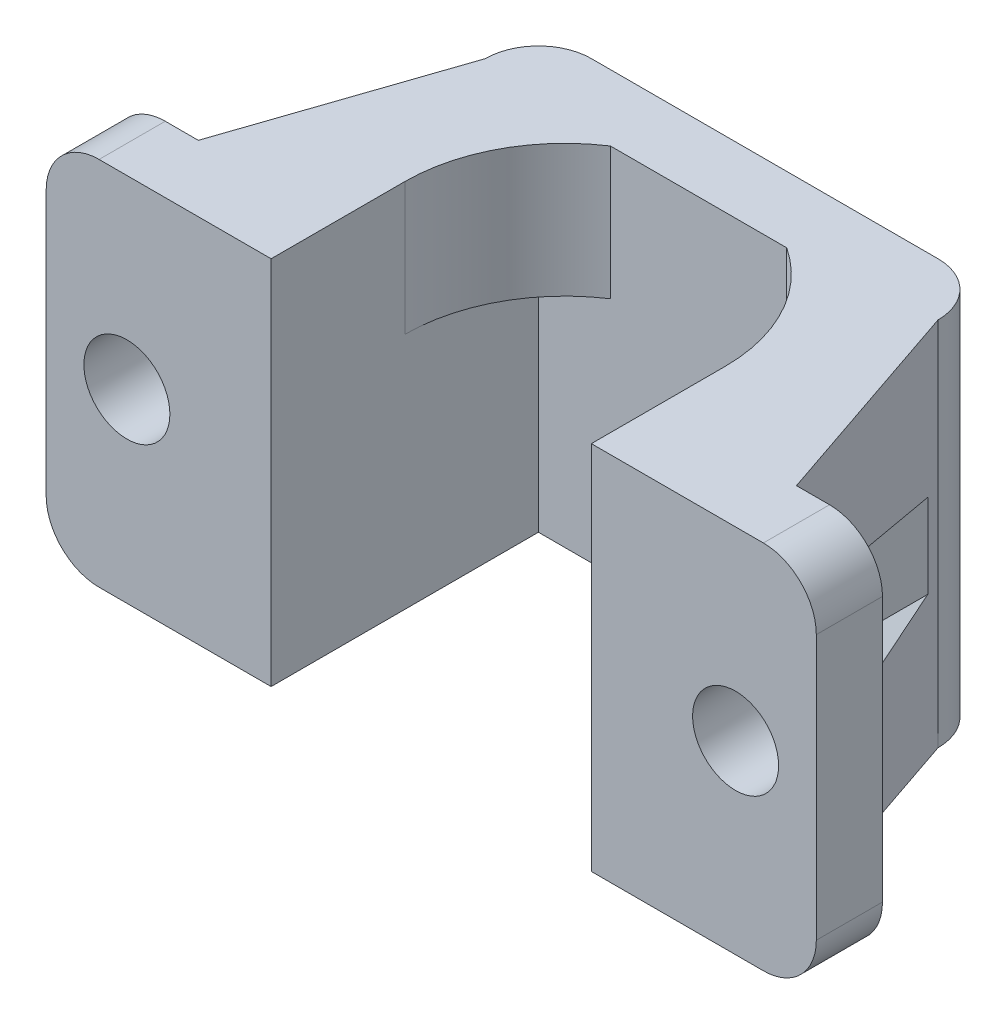
ISO-10303-21;
HEADER;
FILE_DESCRIPTION(('STEP AP214'),'2;1');
FILE_NAME('part.step','',(''),(''),'','','');
FILE_SCHEMA(('AUTOMOTIVE_DESIGN { 1 0 10303 214 1 1 1 1 }'));
ENDSEC;
DATA;
#1=APPLICATION_CONTEXT('core data for automotive mechanical design processes');
#2=APPLICATION_PROTOCOL_DEFINITION('international standard','automotive_design',2000,#1);
#3=PRODUCT_CONTEXT('',#1,'mechanical');
#4=PRODUCT('Part','Part','',(#3));
#5=PRODUCT_RELATED_PRODUCT_CATEGORY('part','',(#4));
#6=PRODUCT_DEFINITION_FORMATION('','',#4);
#7=PRODUCT_DEFINITION_CONTEXT('part definition',#1,'design');
#8=PRODUCT_DEFINITION('design','',#6,#7);
#9=PRODUCT_DEFINITION_SHAPE('','',#8);
#10=(LENGTH_UNIT() NAMED_UNIT(*) SI_UNIT(.MILLI.,.METRE.));
#11=(NAMED_UNIT(*) PLANE_ANGLE_UNIT() SI_UNIT($,.RADIAN.));
#12=(NAMED_UNIT(*) SI_UNIT($,.STERADIAN.) SOLID_ANGLE_UNIT());
#13=UNCERTAINTY_MEASURE_WITH_UNIT(LENGTH_MEASURE(1.E-05),#10,'distance_accuracy_value','');
#14=(GEOMETRIC_REPRESENTATION_CONTEXT(3) GLOBAL_UNCERTAINTY_ASSIGNED_CONTEXT((#13)) GLOBAL_UNIT_ASSIGNED_CONTEXT((#10,
#11,#12)) REPRESENTATION_CONTEXT('',''));
#15=CARTESIAN_POINT('',(0.,0.,0.));
#16=DIRECTION('',(0.,0.,1.));
#17=DIRECTION('',(1.,0.,0.));
#18=AXIS2_PLACEMENT_3D('',#15,#16,#17);
#19=CARTESIAN_POINT('',(0.,14.,-10.1));
#20=DIRECTION('',(0.,0.,-1.));
#21=DIRECTION('',(-1.,0.,0.));
#22=AXIS2_PLACEMENT_3D('',#19,#20,#21);
#23=PLANE('',#22);
#24=DIRECTION('',(0.,1.,0.));
#25=VECTOR('',#24,1.);
#26=CARTESIAN_POINT('',(3.33166624979154,9.,-10.1));
#27=LINE('',#26,#25);
#28=CARTESIAN_POINT('',(3.33166624979154,9.,-10.1));
#29=VERTEX_POINT('',#28);
#30=CARTESIAN_POINT('',(3.33166624979154,14.,-10.1));
#31=VERTEX_POINT('',#30);
#32=EDGE_CURVE('E509',#29,#31,#27,.T.);
#33=ORIENTED_EDGE('',*,*,#32,.T.);
#34=DIRECTION('',(1.,0.,0.));
#35=VECTOR('',#34,1.);
#36=CARTESIAN_POINT('',(0.,14.,-10.1));
#37=LINE('',#36,#35);
#38=CARTESIAN_POINT('',(-3.33166624979154,14.,-10.1));
#39=VERTEX_POINT('',#38);
#40=EDGE_CURVE('E238',#39,#31,#37,.T.);
#41=ORIENTED_EDGE('',*,*,#40,.F.);
#42=DIRECTION('',(0.,1.,0.));
#43=VECTOR('',#42,1.);
#44=CARTESIAN_POINT('',(-3.33166624979154,9.,-10.1));
#45=LINE('',#44,#43);
#46=CARTESIAN_POINT('',(-3.33166624979154,9.,-10.1));
#47=VERTEX_POINT('',#46);
#48=EDGE_CURVE('E231',#47,#39,#45,.T.);
#49=ORIENTED_EDGE('',*,*,#48,.F.);
#50=DIRECTION('',(1.,0.,0.));
#51=VECTOR('',#50,1.);
#52=CARTESIAN_POINT('',(0.,9.,-10.1));
#53=LINE('',#52,#51);
#54=CARTESIAN_POINT('',(-6.05,9.,-10.1));
#55=VERTEX_POINT('',#54);
#56=EDGE_CURVE('E218',#55,#47,#53,.T.);
#57=ORIENTED_EDGE('',*,*,#56,.F.);
#58=DIRECTION('',(0.,-1.,0.));
#59=VECTOR('',#58,1.);
#60=CARTESIAN_POINT('',(-6.05,14.,-10.1));
#61=LINE('',#60,#59);
#62=CARTESIAN_POINT('',(-6.05,0.,-10.1));
#63=VERTEX_POINT('',#62);
#64=EDGE_CURVE('E353',#55,#63,#61,.T.);
#65=ORIENTED_EDGE('',*,*,#64,.T.);
#66=DIRECTION('',(1.,0.,0.));
#67=VECTOR('',#66,1.);
#68=CARTESIAN_POINT('',(0.,0.,-10.1));
#69=LINE('',#68,#67);
#70=CARTESIAN_POINT('',(6.05,0.,-10.1));
#71=VERTEX_POINT('',#70);
#72=EDGE_CURVE('E321',#63,#71,#69,.T.);
#73=ORIENTED_EDGE('',*,*,#72,.T.);
#74=DIRECTION('',(0.,-1.,0.));
#75=VECTOR('',#74,1.);
#76=CARTESIAN_POINT('',(6.05,14.,-10.1));
#77=LINE('',#76,#75);
#78=CARTESIAN_POINT('',(6.05,9.,-10.1));
#79=VERTEX_POINT('',#78);
#80=EDGE_CURVE('E351',#79,#71,#77,.T.);
#81=ORIENTED_EDGE('',*,*,#80,.F.);
#82=DIRECTION('',(1.,0.,0.));
#83=VECTOR('',#82,1.);
#84=CARTESIAN_POINT('',(0.,9.,-10.1));
#85=LINE('',#84,#83);
#86=EDGE_CURVE('E49',#29,#79,#85,.T.);
#87=ORIENTED_EDGE('',*,*,#86,.F.);
#88=EDGE_LOOP('',(#33,#41,#49,#57,#65,#73,#81,#87));
#89=FACE_BOUND('',#88,.T.);
#90=ADVANCED_FACE('F34',(#89),#23,.F.);
#91=CARTESIAN_POINT('',(-10.8931702483857,14.,-3.69829854111859));
#92=DIRECTION('',(-0.946915165682052,0.,-0.3214835439044));
#93=DIRECTION('',(-0.3214835439044,0.,0.946915165682052));
#94=AXIS2_PLACEMENT_3D('',#91,#92,#93);
#95=PLANE('',#94);
#96=DIRECTION('',(0.316084994021358,-0.182491756385032,-0.931013982390181));
#97=VECTOR('',#96,1.);
#98=CARTESIAN_POINT('',(-11.1339921597044,9.96411175542277,-2.98896854777974));
#99=LINE('',#98,#97);
#100=CARTESIAN_POINT('',(-11.3,10.059956426705,-2.5));
#101=VERTEX_POINT('',#100);
#102=CARTESIAN_POINT('',(-8.75,8.58771324027147,-10.0109090909091));
#103=VERTEX_POINT('',#102);
#104=EDGE_CURVE('E270',#101,#103,#99,.T.);
#105=ORIENTED_EDGE('',*,*,#104,.F.);
#106=DIRECTION('',(0.,-1.,0.));
#107=VECTOR('',#106,1.);
#108=CARTESIAN_POINT('',(-11.3,14.,-2.5));
#109=LINE('',#108,#107);
#110=CARTESIAN_POINT('',(-11.3,14.,-2.5));
#111=VERTEX_POINT('',#110);
#112=EDGE_CURVE('E364',#111,#101,#109,.T.);
#113=ORIENTED_EDGE('',*,*,#112,.F.);
#114=DIRECTION('',(0.3214835439044,0.,-0.946915165682052));
#115=VECTOR('',#114,1.);
#116=CARTESIAN_POINT('',(-10.8931702483857,14.,-3.69829854111859));
#117=LINE('',#116,#115);
#118=CARTESIAN_POINT('',(-8.55,14.,-10.6));
#119=VERTEX_POINT('',#118);
#120=EDGE_CURVE('E285',#111,#119,#117,.T.);
#121=ORIENTED_EDGE('',*,*,#120,.T.);
#122=DIRECTION('',(0.,-1.,0.));
#123=VECTOR('',#122,1.);
#124=CARTESIAN_POINT('',(-8.55,14.,-10.6));
#125=LINE('',#124,#123);
#126=CARTESIAN_POINT('',(-8.55,0.,-10.6));
#127=VERTEX_POINT('',#126);
#128=EDGE_CURVE('E367',#119,#127,#125,.T.);
#129=ORIENTED_EDGE('',*,*,#128,.T.);
#130=DIRECTION('',(0.3214835439044,0.,-0.946915165682052));
#131=VECTOR('',#130,1.);
#132=CARTESIAN_POINT('',(-10.8931702483857,0.,-3.69829854111859));
#133=LINE('',#132,#131);
#134=CARTESIAN_POINT('',(-11.3,0.,-2.5));
#135=VERTEX_POINT('',#134);
#136=EDGE_CURVE('E284',#135,#127,#133,.T.);
#137=ORIENTED_EDGE('',*,*,#136,.F.);
#138=CARTESIAN_POINT('',(-11.3,3.94004357329499,-2.5));
#139=VERTEX_POINT('',#138);
#140=EDGE_CURVE('E363',#139,#135,#109,.T.);
#141=ORIENTED_EDGE('',*,*,#140,.F.);
#142=DIRECTION('',(-0.316084994021358,-0.182491756385032,0.931013982390181));
#143=VECTOR('',#142,1.);
#144=CARTESIAN_POINT('',(-10.3264314795417,4.50213362065615,-5.36760182389544));
#145=LINE('',#144,#143);
#146=CARTESIAN_POINT('',(-8.75,5.41228675972853,-10.0109090909091));
#147=VERTEX_POINT('',#146);
#148=EDGE_CURVE('E267',#147,#139,#145,.T.);
#149=ORIENTED_EDGE('',*,*,#148,.F.);
#150=DIRECTION('',(0.,-1.,0.));
#151=VECTOR('',#150,1.);
#152=CARTESIAN_POINT('',(-8.75,14.,-10.0109090909091));
#153=LINE('',#152,#151);
#154=EDGE_CURVE('E370',#103,#147,#153,.T.);
#155=ORIENTED_EDGE('',*,*,#154,.F.);
#156=EDGE_LOOP('',(#105,#113,#121,#129,#137,#141,#149,#155));
#157=FACE_BOUND('',#156,.T.);
#158=ADVANCED_FACE('F452',(#157),#95,.T.);
#159=CARTESIAN_POINT('',(0.,14.,-2.5));
#160=DIRECTION('',(0.,0.,-1.));
#161=DIRECTION('',(-1.,0.,0.));
#162=AXIS2_PLACEMENT_3D('',#159,#160,#161);
#163=PLANE('',#162);
#164=DIRECTION('',(1.,0.,0.));
#165=VECTOR('',#164,1.);
#166=CARTESIAN_POINT('',(0.,0.,-2.5));
#167=LINE('',#166,#165);
#168=CARTESIAN_POINT('',(-12.55,0.,-2.5));
#169=VERTEX_POINT('',#168);
#170=EDGE_CURVE('E313',#169,#135,#167,.T.);
#171=ORIENTED_EDGE('',*,*,#170,.F.);
#172=CARTESIAN_POINT('',(-12.55,2.,-2.5));
#173=DIRECTION('',(0.,0.,-1.));
#174=DIRECTION('',(-1.,0.,0.));
#175=AXIS2_PLACEMENT_3D('',#172,#173,#174);
#176=CIRCLE('',#175,2.);
#177=CARTESIAN_POINT('',(-14.55,2.,-2.5));
#178=VERTEX_POINT('',#177);
#179=EDGE_CURVE('E419',#169,#178,#176,.T.);
#180=ORIENTED_EDGE('',*,*,#179,.T.);
#181=DIRECTION('',(0.,-1.,0.));
#182=VECTOR('',#181,1.);
#183=CARTESIAN_POINT('',(-14.55,14.,-2.5));
#184=LINE('',#183,#182);
#185=CARTESIAN_POINT('',(-14.55,12.,-2.5));
#186=VERTEX_POINT('',#185);
#187=EDGE_CURVE('E360',#186,#178,#184,.T.);
#188=ORIENTED_EDGE('',*,*,#187,.F.);
#189=CARTESIAN_POINT('',(-12.55,12.,-2.5));
#190=DIRECTION('',(0.,0.,-1.));
#191=DIRECTION('',(-1.,0.,0.));
#192=AXIS2_PLACEMENT_3D('',#189,#190,#191);
#193=CIRCLE('',#192,2.);
#194=CARTESIAN_POINT('',(-12.55,14.,-2.5));
#195=VERTEX_POINT('',#194);
#196=EDGE_CURVE('E417',#186,#195,#193,.T.);
#197=ORIENTED_EDGE('',*,*,#196,.T.);
#198=DIRECTION('',(1.,0.,0.));
#199=VECTOR('',#198,1.);
#200=CARTESIAN_POINT('',(0.,14.,-2.5));
#201=LINE('',#200,#199);
#202=EDGE_CURVE('E288',#195,#111,#201,.T.);
#203=ORIENTED_EDGE('',*,*,#202,.T.);
#204=ORIENTED_EDGE('',*,*,#112,.T.);
#205=DIRECTION('',(-0.866025403784439,0.5,0.));
#206=VECTOR('',#205,1.);
#207=CARTESIAN_POINT('',(-8.75,8.58771324027147,-2.5));
#208=LINE('',#207,#206);
#209=CARTESIAN_POINT('',(-8.75,8.58771324027147,-2.5));
#210=VERTEX_POINT('',#209);
#211=EDGE_CURVE('E262',#210,#101,#208,.T.);
#212=ORIENTED_EDGE('',*,*,#211,.F.);
#213=DIRECTION('',(0.,1.,0.));
#214=VECTOR('',#213,1.);
#215=CARTESIAN_POINT('',(-8.75,5.41228675972853,-2.5));
#216=LINE('',#215,#214);
#217=CARTESIAN_POINT('',(-8.75,5.41228675972853,-2.5));
#218=VERTEX_POINT('',#217);
#219=EDGE_CURVE('E259',#218,#210,#216,.T.);
#220=ORIENTED_EDGE('',*,*,#219,.F.);
#221=DIRECTION('',(0.866025403784438,0.5,0.));
#222=VECTOR('',#221,1.);
#223=CARTESIAN_POINT('',(-11.5,3.82457351945706,-2.5));
#224=LINE('',#223,#222);
#225=EDGE_CURVE('E255',#139,#218,#224,.T.);
#226=ORIENTED_EDGE('',*,*,#225,.F.);
#227=ORIENTED_EDGE('',*,*,#140,.T.);
#228=EDGE_LOOP('',(#171,#180,#188,#197,#203,#204,#212,#220,#226,#227));
#229=FACE_BOUND('',#228,.T.);
#230=CARTESIAN_POINT('',(-11.5,7.,-2.5));
#231=DIRECTION('',(0.,0.,-1.));
#232=DIRECTION('',(-1.,0.,0.));
#233=AXIS2_PLACEMENT_3D('',#230,#231,#232);
#234=CIRCLE('',#233,1.625);
#235=CARTESIAN_POINT('',(-13.125,7.,-2.5));
#236=VERTEX_POINT('',#235);
#237=EDGE_CURVE('E281',#236,#236,#234,.T.);
#238=ORIENTED_EDGE('',*,*,#237,.F.);
#239=EDGE_LOOP('',(#238));
#240=FACE_BOUND('',#239,.T.);
#241=ADVANCED_FACE('F441',(#229,#240),#163,.T.);
#242=CARTESIAN_POINT('',(-14.55,14.,0.));
#243=DIRECTION('',(-1.,0.,0.));
#244=DIRECTION('',(0.,0.,1.));
#245=AXIS2_PLACEMENT_3D('',#242,#243,#244);
#246=PLANE('',#245);
#247=ORIENTED_EDGE('',*,*,#187,.T.);
#248=DIRECTION('',(0.,0.,-1.));
#249=VECTOR('',#248,1.);
#250=CARTESIAN_POINT('',(-14.55,2.,0.));
#251=LINE('',#250,#249);
#252=CARTESIAN_POINT('',(-14.55,2.,0.));
#253=VERTEX_POINT('',#252);
#254=EDGE_CURVE('E424',#178,#253,#251,.F.);
#255=ORIENTED_EDGE('',*,*,#254,.T.);
#256=DIRECTION('',(0.,-1.,0.));
#257=VECTOR('',#256,1.);
#258=CARTESIAN_POINT('',(-14.55,14.,0.));
#259=LINE('',#258,#257);
#260=CARTESIAN_POINT('',(-14.55,12.,0.));
#261=VERTEX_POINT('',#260);
#262=EDGE_CURVE('E357',#261,#253,#259,.T.);
#263=ORIENTED_EDGE('',*,*,#262,.F.);
#264=DIRECTION('',(0.,0.,-1.));
#265=VECTOR('',#264,1.);
#266=CARTESIAN_POINT('',(-14.55,12.,0.));
#267=LINE('',#266,#265);
#268=EDGE_CURVE('E421',#261,#186,#267,.T.);
#269=ORIENTED_EDGE('',*,*,#268,.T.);
#270=EDGE_LOOP('',(#247,#255,#263,#269));
#271=FACE_BOUND('',#270,.T.);
#272=ADVANCED_FACE('F435',(#271),#246,.T.);
#273=CARTESIAN_POINT('',(0.,14.,0.));
#274=DIRECTION('',(0.,0.,1.));
#275=DIRECTION('',(1.,0.,0.));
#276=AXIS2_PLACEMENT_3D('',#273,#274,#275);
#277=PLANE('',#276);
#278=CARTESIAN_POINT('',(-11.5,7.,0.));
#279=DIRECTION('',(0.,0.,1.));
#280=DIRECTION('',(1.,0.,0.));
#281=AXIS2_PLACEMENT_3D('',#278,#279,#280);
#282=CIRCLE('',#281,1.625);
#283=CARTESIAN_POINT('',(-9.875,7.,0.));
#284=VERTEX_POINT('',#283);
#285=EDGE_CURVE('E278',#284,#284,#282,.T.);
#286=ORIENTED_EDGE('',*,*,#285,.F.);
#287=EDGE_LOOP('',(#286));
#288=FACE_BOUND('',#287,.T.);
#289=ORIENTED_EDGE('',*,*,#262,.T.);
#290=CARTESIAN_POINT('',(-12.55,2.,0.));
#291=DIRECTION('',(0.,0.,1.));
#292=DIRECTION('',(1.,0.,0.));
#293=AXIS2_PLACEMENT_3D('',#290,#291,#292);
#294=CIRCLE('',#293,2.);
#295=CARTESIAN_POINT('',(-12.55,0.,0.));
#296=VERTEX_POINT('',#295);
#297=EDGE_CURVE('E11',#253,#296,#294,.T.);
#298=ORIENTED_EDGE('',*,*,#297,.T.);
#299=DIRECTION('',(-1.,0.,0.));
#300=VECTOR('',#299,1.);
#301=CARTESIAN_POINT('',(0.,0.,0.));
#302=LINE('',#301,#300);
#303=CARTESIAN_POINT('',(-6.05,0.,0.));
#304=VERTEX_POINT('',#303);
#305=EDGE_CURVE('E315',#304,#296,#302,.T.);
#306=ORIENTED_EDGE('',*,*,#305,.F.);
#307=DIRECTION('',(0.,-1.,0.));
#308=VECTOR('',#307,1.);
#309=CARTESIAN_POINT('',(-6.05,14.,0.));
#310=LINE('',#309,#308);
#311=CARTESIAN_POINT('',(-6.05,14.,0.));
#312=VERTEX_POINT('',#311);
#313=EDGE_CURVE('E355',#312,#304,#310,.T.);
#314=ORIENTED_EDGE('',*,*,#313,.F.);
#315=DIRECTION('',(-1.,0.,0.));
#316=VECTOR('',#315,1.);
#317=CARTESIAN_POINT('',(0.,14.,0.));
#318=LINE('',#317,#316);
#319=CARTESIAN_POINT('',(-12.55,14.,0.));
#320=VERTEX_POINT('',#319);
#321=EDGE_CURVE('E291',#312,#320,#318,.T.);
#322=ORIENTED_EDGE('',*,*,#321,.T.);
#323=CARTESIAN_POINT('',(-12.55,12.,0.));
#324=DIRECTION('',(0.,0.,1.));
#325=DIRECTION('',(1.,0.,0.));
#326=AXIS2_PLACEMENT_3D('',#323,#324,#325);
#327=CIRCLE('',#326,2.);
#328=EDGE_CURVE('E42',#320,#261,#327,.T.);
#329=ORIENTED_EDGE('',*,*,#328,.T.);
#330=EDGE_LOOP('',(#289,#298,#306,#314,#322,#329));
#331=FACE_BOUND('',#330,.T.);
#332=ADVANCED_FACE('F428',(#288,#331),#277,.T.);
#333=CARTESIAN_POINT('',(-6.05,14.,0.));
#334=DIRECTION('',(-1.,0.,0.));
#335=DIRECTION('',(0.,0.,1.));
#336=AXIS2_PLACEMENT_3D('',#333,#334,#335);
#337=PLANE('',#336);
#338=DIRECTION('',(0.,0.,-1.));
#339=VECTOR('',#338,1.);
#340=CARTESIAN_POINT('',(-6.05,9.,0.));
#341=LINE('',#340,#339);
#342=CARTESIAN_POINT('',(-6.05,9.,-5.05));
#343=VERTEX_POINT('',#342);
#344=EDGE_CURVE('E224',#343,#55,#341,.T.);
#345=ORIENTED_EDGE('',*,*,#344,.F.);
#346=DIRECTION('',(0.,1.,0.));
#347=VECTOR('',#346,1.);
#348=CARTESIAN_POINT('',(-6.05,9.,-5.05));
#349=LINE('',#348,#347);
#350=CARTESIAN_POINT('',(-6.05,14.,-5.05));
#351=VERTEX_POINT('',#350);
#352=EDGE_CURVE('E234',#343,#351,#349,.T.);
#353=ORIENTED_EDGE('',*,*,#352,.T.);
#354=DIRECTION('',(0.,0.,-1.));
#355=VECTOR('',#354,1.);
#356=CARTESIAN_POINT('',(-6.05,14.,0.));
#357=LINE('',#356,#355);
#358=EDGE_CURVE('E294',#312,#351,#357,.T.);
#359=ORIENTED_EDGE('',*,*,#358,.F.);
#360=ORIENTED_EDGE('',*,*,#313,.T.);
#361=DIRECTION('',(0.,0.,-1.));
#362=VECTOR('',#361,1.);
#363=CARTESIAN_POINT('',(-6.05,0.,0.));
#364=LINE('',#363,#362);
#365=EDGE_CURVE('E318',#304,#63,#364,.T.);
#366=ORIENTED_EDGE('',*,*,#365,.T.);
#367=ORIENTED_EDGE('',*,*,#64,.F.);
#368=EDGE_LOOP('',(#345,#353,#359,#360,#366,#367));
#369=FACE_BOUND('',#368,.T.);
#370=ADVANCED_FACE('F517',(#369),#337,.F.);
#371=CARTESIAN_POINT('',(6.05,14.,0.));
#372=DIRECTION('',(-1.,0.,0.));
#373=DIRECTION('',(0.,0.,1.));
#374=AXIS2_PLACEMENT_3D('',#371,#372,#373);
#375=PLANE('',#374);
#376=DIRECTION('',(0.,1.,0.));
#377=VECTOR('',#376,1.);
#378=CARTESIAN_POINT('',(6.05,9.,-5.05));
#379=LINE('',#378,#377);
#380=CARTESIAN_POINT('',(6.05,9.,-5.05));
#381=VERTEX_POINT('',#380);
#382=CARTESIAN_POINT('',(6.05,14.,-5.05));
#383=VERTEX_POINT('',#382);
#384=EDGE_CURVE('E57',#381,#383,#379,.T.);
#385=ORIENTED_EDGE('',*,*,#384,.F.);
#386=DIRECTION('',(0.,0.,1.));
#387=VECTOR('',#386,1.);
#388=CARTESIAN_POINT('',(6.05,9.,0.));
#389=LINE('',#388,#387);
#390=EDGE_CURVE('E512',#79,#381,#389,.T.);
#391=ORIENTED_EDGE('',*,*,#390,.F.);
#392=ORIENTED_EDGE('',*,*,#80,.T.);
#393=DIRECTION('',(0.,0.,-1.));
#394=VECTOR('',#393,1.);
#395=CARTESIAN_POINT('',(6.05,0.,0.));
#396=LINE('',#395,#394);
#397=CARTESIAN_POINT('',(6.05,0.,0.));
#398=VERTEX_POINT('',#397);
#399=EDGE_CURVE('E324',#398,#71,#396,.T.);
#400=ORIENTED_EDGE('',*,*,#399,.F.);
#401=DIRECTION('',(0.,-1.,0.));
#402=VECTOR('',#401,1.);
#403=CARTESIAN_POINT('',(6.05,14.,0.));
#404=LINE('',#403,#402);
#405=CARTESIAN_POINT('',(6.05,14.,0.));
#406=VERTEX_POINT('',#405);
#407=EDGE_CURVE('E349',#406,#398,#404,.T.);
#408=ORIENTED_EDGE('',*,*,#407,.F.);
#409=DIRECTION('',(0.,0.,-1.));
#410=VECTOR('',#409,1.);
#411=CARTESIAN_POINT('',(6.05,14.,0.));
#412=LINE('',#411,#410);
#413=EDGE_CURVE('E298',#406,#383,#412,.T.);
#414=ORIENTED_EDGE('',*,*,#413,.T.);
#415=EDGE_LOOP('',(#385,#391,#392,#400,#408,#414));
#416=FACE_BOUND('',#415,.T.);
#417=ADVANCED_FACE('F502',(#416),#375,.T.);
#418=CARTESIAN_POINT('',(0.,14.,0.));
#419=DIRECTION('',(0.,0.,-1.));
#420=DIRECTION('',(-1.,0.,0.));
#421=AXIS2_PLACEMENT_3D('',#418,#419,#420);
#422=PLANE('',#421);
#423=CARTESIAN_POINT('',(11.5,7.,0.));
#424=DIRECTION('',(0.,0.,1.));
#425=DIRECTION('',(-1.,0.,0.));
#426=AXIS2_PLACEMENT_3D('',#423,#424,#425);
#427=CIRCLE('',#426,1.625);
#428=CARTESIAN_POINT('',(9.875,7.,0.));
#429=VERTEX_POINT('',#428);
#430=EDGE_CURVE('E272',#429,#429,#427,.T.);
#431=ORIENTED_EDGE('',*,*,#430,.F.);
#432=EDGE_LOOP('',(#431));
#433=FACE_BOUND('',#432,.T.);
#434=DIRECTION('',(1.,0.,0.));
#435=VECTOR('',#434,1.);
#436=CARTESIAN_POINT('',(0.,0.,0.));
#437=LINE('',#436,#435);
#438=CARTESIAN_POINT('',(12.55,0.,0.));
#439=VERTEX_POINT('',#438);
#440=EDGE_CURVE('E327',#398,#439,#437,.T.);
#441=ORIENTED_EDGE('',*,*,#440,.T.);
#442=CARTESIAN_POINT('',(12.55,2.,0.));
#443=DIRECTION('',(0.,0.,-1.));
#444=DIRECTION('',(-1.,0.,0.));
#445=AXIS2_PLACEMENT_3D('',#442,#443,#444);
#446=CIRCLE('',#445,2.);
#447=CARTESIAN_POINT('',(14.55,2.,0.));
#448=VERTEX_POINT('',#447);
#449=EDGE_CURVE('E415',#439,#448,#446,.F.);
#450=ORIENTED_EDGE('',*,*,#449,.T.);
#451=DIRECTION('',(0.,-1.,0.));
#452=VECTOR('',#451,1.);
#453=CARTESIAN_POINT('',(14.55,14.,0.));
#454=LINE('',#453,#452);
#455=CARTESIAN_POINT('',(14.55,12.,0.));
#456=VERTEX_POINT('',#455);
#457=EDGE_CURVE('E346',#456,#448,#454,.T.);
#458=ORIENTED_EDGE('',*,*,#457,.F.);
#459=CARTESIAN_POINT('',(12.55,12.,0.));
#460=DIRECTION('',(0.,0.,-1.));
#461=DIRECTION('',(-1.,0.,0.));
#462=AXIS2_PLACEMENT_3D('',#459,#460,#461);
#463=CIRCLE('',#462,2.);
#464=CARTESIAN_POINT('',(12.55,14.,0.));
#465=VERTEX_POINT('',#464);
#466=EDGE_CURVE('E413',#456,#465,#463,.F.);
#467=ORIENTED_EDGE('',*,*,#466,.T.);
#468=DIRECTION('',(1.,0.,0.));
#469=VECTOR('',#468,1.);
#470=CARTESIAN_POINT('',(0.,14.,0.));
#471=LINE('',#470,#469);
#472=EDGE_CURVE('E300',#406,#465,#471,.T.);
#473=ORIENTED_EDGE('',*,*,#472,.F.);
#474=ORIENTED_EDGE('',*,*,#407,.T.);
#475=EDGE_LOOP('',(#441,#450,#458,#467,#473,#474));
#476=FACE_BOUND('',#475,.T.);
#477=ADVANCED_FACE('F487',(#433,#476),#422,.F.);
#478=CARTESIAN_POINT('',(14.55,14.,0.));
#479=DIRECTION('',(-1.,0.,0.));
#480=DIRECTION('',(0.,0.,1.));
#481=AXIS2_PLACEMENT_3D('',#478,#479,#480);
#482=PLANE('',#481);
#483=ORIENTED_EDGE('',*,*,#457,.T.);
#484=DIRECTION('',(0.,0.,-1.));
#485=VECTOR('',#484,1.);
#486=CARTESIAN_POINT('',(14.55,2.,0.));
#487=LINE('',#486,#485);
#488=CARTESIAN_POINT('',(14.55,2.,-2.5));
#489=VERTEX_POINT('',#488);
#490=EDGE_CURVE('E406',#448,#489,#487,.T.);
#491=ORIENTED_EDGE('',*,*,#490,.T.);
#492=DIRECTION('',(0.,-1.,0.));
#493=VECTOR('',#492,1.);
#494=CARTESIAN_POINT('',(14.55,14.,-2.5));
#495=LINE('',#494,#493);
#496=CARTESIAN_POINT('',(14.55,12.,-2.5));
#497=VERTEX_POINT('',#496);
#498=EDGE_CURVE('E343',#497,#489,#495,.T.);
#499=ORIENTED_EDGE('',*,*,#498,.F.);
#500=DIRECTION('',(0.,0.,-1.));
#501=VECTOR('',#500,1.);
#502=CARTESIAN_POINT('',(14.55,12.,0.));
#503=LINE('',#502,#501);
#504=EDGE_CURVE('E404',#497,#456,#503,.F.);
#505=ORIENTED_EDGE('',*,*,#504,.T.);
#506=EDGE_LOOP('',(#483,#491,#499,#505));
#507=FACE_BOUND('',#506,.T.);
#508=ADVANCED_FACE('F490',(#507),#482,.F.);
#509=CARTESIAN_POINT('',(0.,14.,-2.5));
#510=DIRECTION('',(0.,0.,1.));
#511=DIRECTION('',(1.,0.,0.));
#512=AXIS2_PLACEMENT_3D('',#509,#510,#511);
#513=PLANE('',#512);
#514=ORIENTED_EDGE('',*,*,#498,.T.);
#515=CARTESIAN_POINT('',(12.55,2.,-2.5));
#516=DIRECTION('',(0.,0.,1.));
#517=DIRECTION('',(1.,0.,0.));
#518=AXIS2_PLACEMENT_3D('',#515,#516,#517);
#519=CIRCLE('',#518,2.);
#520=CARTESIAN_POINT('',(12.55,0.,-2.5));
#521=VERTEX_POINT('',#520);
#522=EDGE_CURVE('E411',#489,#521,#519,.F.);
#523=ORIENTED_EDGE('',*,*,#522,.T.);
#524=DIRECTION('',(-1.,0.,0.));
#525=VECTOR('',#524,1.);
#526=CARTESIAN_POINT('',(0.,0.,-2.5));
#527=LINE('',#526,#525);
#528=CARTESIAN_POINT('',(11.3,0.,-2.5));
#529=VERTEX_POINT('',#528);
#530=EDGE_CURVE('E330',#521,#529,#527,.T.);
#531=ORIENTED_EDGE('',*,*,#530,.T.);
#532=DIRECTION('',(0.,-1.,0.));
#533=VECTOR('',#532,1.);
#534=CARTESIAN_POINT('',(11.3,14.,-2.5));
#535=LINE('',#534,#533);
#536=CARTESIAN_POINT('',(11.3,3.94004357329498,-2.5));
#537=VERTEX_POINT('',#536);
#538=EDGE_CURVE('E339',#537,#529,#535,.T.);
#539=ORIENTED_EDGE('',*,*,#538,.F.);
#540=DIRECTION('',(0.866025403784439,-0.5,0.));
#541=VECTOR('',#540,1.);
#542=CARTESIAN_POINT('',(8.75,5.41228675972853,-2.5));
#543=LINE('',#542,#541);
#544=CARTESIAN_POINT('',(8.75,5.41228675972853,-2.5));
#545=VERTEX_POINT('',#544);
#546=EDGE_CURVE('E240',#545,#537,#543,.T.);
#547=ORIENTED_EDGE('',*,*,#546,.F.);
#548=DIRECTION('',(0.,-1.,0.));
#549=VECTOR('',#548,1.);
#550=CARTESIAN_POINT('',(8.75,8.58771324027147,-2.5));
#551=LINE('',#550,#549);
#552=CARTESIAN_POINT('',(8.75,8.58771324027147,-2.5));
#553=VERTEX_POINT('',#552);
#554=EDGE_CURVE('E249',#553,#545,#551,.T.);
#555=ORIENTED_EDGE('',*,*,#554,.F.);
#556=DIRECTION('',(-0.866025403784438,-0.5,0.));
#557=VECTOR('',#556,1.);
#558=CARTESIAN_POINT('',(11.5,10.1754264805429,-2.5));
#559=LINE('',#558,#557);
#560=CARTESIAN_POINT('',(11.3,10.059956426705,-2.5));
#561=VERTEX_POINT('',#560);
#562=EDGE_CURVE('E246',#561,#553,#559,.T.);
#563=ORIENTED_EDGE('',*,*,#562,.F.);
#564=CARTESIAN_POINT('',(11.3,14.,-2.5));
#565=VERTEX_POINT('',#564);
#566=EDGE_CURVE('E340',#565,#561,#535,.T.);
#567=ORIENTED_EDGE('',*,*,#566,.F.);
#568=DIRECTION('',(-1.,0.,0.));
#569=VECTOR('',#568,1.);
#570=CARTESIAN_POINT('',(0.,14.,-2.5));
#571=LINE('',#570,#569);
#572=CARTESIAN_POINT('',(12.55,14.,-2.5));
#573=VERTEX_POINT('',#572);
#574=EDGE_CURVE('E303',#573,#565,#571,.T.);
#575=ORIENTED_EDGE('',*,*,#574,.F.);
#576=CARTESIAN_POINT('',(12.55,12.,-2.5));
#577=DIRECTION('',(0.,0.,1.));
#578=DIRECTION('',(1.,0.,0.));
#579=AXIS2_PLACEMENT_3D('',#576,#577,#578);
#580=CIRCLE('',#579,2.);
#581=EDGE_CURVE('E409',#573,#497,#580,.F.);
#582=ORIENTED_EDGE('',*,*,#581,.T.);
#583=EDGE_LOOP('',(#514,#523,#531,#539,#547,#555,#563,#567,#575,#582));
#584=FACE_BOUND('',#583,.T.);
#585=CARTESIAN_POINT('',(11.5,7.,-2.5));
#586=DIRECTION('',(0.,0.,1.));
#587=DIRECTION('',(1.,0.,0.));
#588=AXIS2_PLACEMENT_3D('',#585,#586,#587);
#589=CIRCLE('',#588,1.625);
#590=CARTESIAN_POINT('',(13.125,7.,-2.5));
#591=VERTEX_POINT('',#590);
#592=EDGE_CURVE('E275',#591,#591,#589,.T.);
#593=ORIENTED_EDGE('',*,*,#592,.T.);
#594=EDGE_LOOP('',(#593));
#595=FACE_BOUND('',#594,.T.);
#596=ADVANCED_FACE('F476',(#584,#595),#513,.F.);
#597=CARTESIAN_POINT('',(10.8931702483857,14.,-3.69829854111859));
#598=DIRECTION('',(-0.946915165682052,0.,0.3214835439044));
#599=DIRECTION('',(0.3214835439044,0.,0.946915165682052));
#600=AXIS2_PLACEMENT_3D('',#597,#598,#599);
#601=PLANE('',#600);
#602=DIRECTION('',(0.,-1.,0.));
#603=VECTOR('',#602,1.);
#604=CARTESIAN_POINT('',(8.75,14.,-10.0109090909091));
#605=LINE('',#604,#603);
#606=CARTESIAN_POINT('',(8.75,8.58771324027147,-10.0109090909091));
#607=VERTEX_POINT('',#606);
#608=CARTESIAN_POINT('',(8.75,5.41228675972853,-10.0109090909091));
#609=VERTEX_POINT('',#608);
#610=EDGE_CURVE('E375',#607,#609,#605,.T.);
#611=ORIENTED_EDGE('',*,*,#610,.T.);
#612=DIRECTION('',(0.316084994021358,-0.182491756385032,0.931013982390181));
#613=VECTOR('',#612,1.);
#614=CARTESIAN_POINT('',(10.3264314795417,4.50213362065614,-5.36760182389544));
#615=LINE('',#614,#613);
#616=EDGE_CURVE('E378',#609,#537,#615,.T.);
#617=ORIENTED_EDGE('',*,*,#616,.T.);
#618=ORIENTED_EDGE('',*,*,#538,.T.);
#619=DIRECTION('',(-0.3214835439044,0.,-0.946915165682052));
#620=VECTOR('',#619,1.);
#621=CARTESIAN_POINT('',(10.8931702483857,0.,-3.69829854111859));
#622=LINE('',#621,#620);
#623=CARTESIAN_POINT('',(8.55,0.,-10.6));
#624=VERTEX_POINT('',#623);
#625=EDGE_CURVE('E332',#529,#624,#622,.T.);
#626=ORIENTED_EDGE('',*,*,#625,.T.);
#627=DIRECTION('',(0.,-1.,0.));
#628=VECTOR('',#627,1.);
#629=CARTESIAN_POINT('',(8.55,14.,-10.6));
#630=LINE('',#629,#628);
#631=CARTESIAN_POINT('',(8.55,14.,-10.6));
#632=VERTEX_POINT('',#631);
#633=EDGE_CURVE('E310',#632,#624,#630,.T.);
#634=ORIENTED_EDGE('',*,*,#633,.F.);
#635=DIRECTION('',(-0.3214835439044,0.,-0.946915165682052));
#636=VECTOR('',#635,1.);
#637=CARTESIAN_POINT('',(10.8931702483857,14.,-3.69829854111859));
#638=LINE('',#637,#636);
#639=EDGE_CURVE('E305',#565,#632,#638,.T.);
#640=ORIENTED_EDGE('',*,*,#639,.F.);
#641=ORIENTED_EDGE('',*,*,#566,.T.);
#642=DIRECTION('',(-0.316084994021358,-0.182491756385032,-0.931013982390181));
#643=VECTOR('',#642,1.);
#644=CARTESIAN_POINT('',(11.1339921597044,9.96411175542277,-2.98896854777974));
#645=LINE('',#644,#643);
#646=EDGE_CURVE('E372',#561,#607,#645,.T.);
#647=ORIENTED_EDGE('',*,*,#646,.T.);
#648=EDGE_LOOP('',(#611,#617,#618,#626,#634,#640,#641,#647));
#649=FACE_BOUND('',#648,.T.);
#650=ADVANCED_FACE('F471',(#649),#601,.F.);
#651=CARTESIAN_POINT('',(0.,14.,-12.6));
#652=DIRECTION('',(0.,0.,-1.));
#653=DIRECTION('',(-1.,0.,0.));
#654=AXIS2_PLACEMENT_3D('',#651,#652,#653);
#655=PLANE('',#654);
#656=DIRECTION('',(1.,0.,0.));
#657=VECTOR('',#656,1.);
#658=CARTESIAN_POINT('',(0.,0.,-12.6));
#659=LINE('',#658,#657);
#660=CARTESIAN_POINT('',(-6.55,0.,-12.6));
#661=VERTEX_POINT('',#660);
#662=CARTESIAN_POINT('',(6.55,0.,-12.6));
#663=VERTEX_POINT('',#662);
#664=EDGE_CURVE('E289',#661,#663,#659,.T.);
#665=ORIENTED_EDGE('',*,*,#664,.F.);
#666=DIRECTION('',(0.,-1.,0.));
#667=VECTOR('',#666,1.);
#668=CARTESIAN_POINT('',(-6.55,14.,-12.6));
#669=LINE('',#668,#667);
#670=CARTESIAN_POINT('',(-6.55,14.,-12.6));
#671=VERTEX_POINT('',#670);
#672=EDGE_CURVE('E393',#661,#671,#669,.F.);
#673=ORIENTED_EDGE('',*,*,#672,.T.);
#674=DIRECTION('',(1.,0.,0.));
#675=VECTOR('',#674,1.);
#676=CARTESIAN_POINT('',(0.,14.,-12.6));
#677=LINE('',#676,#675);
#678=CARTESIAN_POINT('',(6.55,14.,-12.6));
#679=VERTEX_POINT('',#678);
#680=EDGE_CURVE('E307',#671,#679,#677,.T.);
#681=ORIENTED_EDGE('',*,*,#680,.T.);
#682=DIRECTION('',(0.,-1.,0.));
#683=VECTOR('',#682,1.);
#684=CARTESIAN_POINT('',(6.55,0.,-12.6));
#685=LINE('',#684,#683);
#686=EDGE_CURVE('E390',#679,#663,#685,.T.);
#687=ORIENTED_EDGE('',*,*,#686,.T.);
#688=EDGE_LOOP('',(#665,#673,#681,#687));
#689=FACE_BOUND('',#688,.T.);
#690=ADVANCED_FACE('F461',(#689),#655,.T.);
#691=CARTESIAN_POINT('',(0.,14.,0.));
#692=DIRECTION('',(0.,1.,0.));
#693=DIRECTION('',(0.,0.,1.));
#694=AXIS2_PLACEMENT_3D('',#691,#692,#693);
#695=PLANE('',#694);
#696=ORIENTED_EDGE('',*,*,#680,.F.);
#697=CARTESIAN_POINT('',(-6.55,14.,-10.6));
#698=DIRECTION('',(0.,1.,0.));
#699=DIRECTION('',(0.,0.,1.));
#700=AXIS2_PLACEMENT_3D('',#697,#698,#699);
#701=CIRCLE('',#700,2.);
#702=EDGE_CURVE('E402',#671,#119,#701,.T.);
#703=ORIENTED_EDGE('',*,*,#702,.T.);
#704=ORIENTED_EDGE('',*,*,#120,.F.);
#705=ORIENTED_EDGE('',*,*,#202,.F.);
#706=DIRECTION('',(0.,0.,-1.));
#707=VECTOR('',#706,1.);
#708=CARTESIAN_POINT('',(-12.55,14.,0.));
#709=LINE('',#708,#707);
#710=EDGE_CURVE('E395',#195,#320,#709,.F.);
#711=ORIENTED_EDGE('',*,*,#710,.T.);
#712=ORIENTED_EDGE('',*,*,#321,.F.);
#713=ORIENTED_EDGE('',*,*,#358,.T.);
#714=CARTESIAN_POINT('',(0.,14.,-5.05));
#715=DIRECTION('',(0.,1.,0.));
#716=DIRECTION('',(0.,0.,1.));
#717=AXIS2_PLACEMENT_3D('',#714,#715,#716);
#718=CIRCLE('',#717,6.05);
#719=EDGE_CURVE('E235',#39,#351,#718,.T.);
#720=ORIENTED_EDGE('',*,*,#719,.F.);
#721=ORIENTED_EDGE('',*,*,#40,.T.);
#722=CARTESIAN_POINT('',(0.,14.,-5.05));
#723=DIRECTION('',(0.,1.,0.));
#724=DIRECTION('',(0.,0.,1.));
#725=AXIS2_PLACEMENT_3D('',#722,#723,#724);
#726=CIRCLE('',#725,6.05);
#727=EDGE_CURVE('E501',#383,#31,#726,.T.);
#728=ORIENTED_EDGE('',*,*,#727,.F.);
#729=ORIENTED_EDGE('',*,*,#413,.F.);
#730=ORIENTED_EDGE('',*,*,#472,.T.);
#731=DIRECTION('',(0.,0.,-1.));
#732=VECTOR('',#731,1.);
#733=CARTESIAN_POINT('',(12.55,14.,-2.5));
#734=LINE('',#733,#732);
#735=EDGE_CURVE('E397',#465,#573,#734,.T.);
#736=ORIENTED_EDGE('',*,*,#735,.T.);
#737=ORIENTED_EDGE('',*,*,#574,.T.);
#738=ORIENTED_EDGE('',*,*,#639,.T.);
#739=CARTESIAN_POINT('',(6.55,14.,-10.6));
#740=DIRECTION('',(0.,1.,0.));
#741=DIRECTION('',(0.,0.,1.));
#742=AXIS2_PLACEMENT_3D('',#739,#740,#741);
#743=CIRCLE('',#742,2.);
#744=EDGE_CURVE('E400',#632,#679,#743,.T.);
#745=ORIENTED_EDGE('',*,*,#744,.T.);
#746=EDGE_LOOP('',(#696,#703,#704,#705,#711,#712,#713,#720,#721,#728,#729,#730,#736,#737,#738,#745));
#747=FACE_BOUND('',#746,.T.);
#748=ADVANCED_FACE('F447',(#747),#695,.T.);
#749=CARTESIAN_POINT('',(0.,0.,0.));
#750=DIRECTION('',(0.,1.,0.));
#751=DIRECTION('',(0.,0.,1.));
#752=AXIS2_PLACEMENT_3D('',#749,#750,#751);
#753=PLANE('',#752);
#754=ORIENTED_EDGE('',*,*,#136,.T.);
#755=CARTESIAN_POINT('',(-6.55,0.,-10.6));
#756=DIRECTION('',(0.,1.,0.));
#757=DIRECTION('',(0.,0.,1.));
#758=AXIS2_PLACEMENT_3D('',#755,#756,#757);
#759=CIRCLE('',#758,2.);
#760=EDGE_CURVE('E388',#127,#661,#759,.F.);
#761=ORIENTED_EDGE('',*,*,#760,.T.);
#762=ORIENTED_EDGE('',*,*,#664,.T.);
#763=CARTESIAN_POINT('',(6.55,0.,-10.6));
#764=DIRECTION('',(0.,1.,0.));
#765=DIRECTION('',(0.,0.,1.));
#766=AXIS2_PLACEMENT_3D('',#763,#764,#765);
#767=CIRCLE('',#766,2.);
#768=EDGE_CURVE('E386',#663,#624,#767,.F.);
#769=ORIENTED_EDGE('',*,*,#768,.T.);
#770=ORIENTED_EDGE('',*,*,#625,.F.);
#771=ORIENTED_EDGE('',*,*,#530,.F.);
#772=DIRECTION('',(0.,0.,-1.));
#773=VECTOR('',#772,1.);
#774=CARTESIAN_POINT('',(12.55,0.,0.));
#775=LINE('',#774,#773);
#776=EDGE_CURVE('E384',#521,#439,#775,.F.);
#777=ORIENTED_EDGE('',*,*,#776,.T.);
#778=ORIENTED_EDGE('',*,*,#440,.F.);
#779=ORIENTED_EDGE('',*,*,#399,.T.);
#780=ORIENTED_EDGE('',*,*,#72,.F.);
#781=ORIENTED_EDGE('',*,*,#365,.F.);
#782=ORIENTED_EDGE('',*,*,#305,.T.);
#783=DIRECTION('',(0.,0.,-1.));
#784=VECTOR('',#783,1.);
#785=CARTESIAN_POINT('',(-12.55,0.,-2.5));
#786=LINE('',#785,#784);
#787=EDGE_CURVE('E381',#296,#169,#786,.T.);
#788=ORIENTED_EDGE('',*,*,#787,.T.);
#789=ORIENTED_EDGE('',*,*,#170,.T.);
#790=EDGE_LOOP('',(#754,#761,#762,#769,#770,#771,#777,#778,#779,#780,#781,#782,#788,#789));
#791=FACE_BOUND('',#790,.T.);
#792=ADVANCED_FACE('F459',(#791),#753,.F.);
#793=CARTESIAN_POINT('',(-11.5,7.,-14.));
#794=DIRECTION('',(0.,0.,1.));
#795=DIRECTION('',(1.,0.,0.));
#796=AXIS2_PLACEMENT_3D('',#793,#794,#795);
#797=CYLINDRICAL_SURFACE('',#796,1.625);
#798=ORIENTED_EDGE('',*,*,#237,.T.);
#799=EDGE_LOOP('',(#798));
#800=FACE_BOUND('',#799,.T.);
#801=ORIENTED_EDGE('',*,*,#285,.T.);
#802=EDGE_LOOP('',(#801));
#803=FACE_BOUND('',#802,.T.);
#804=ADVANCED_FACE('F587',(#800,#803),#797,.F.);
#805=CARTESIAN_POINT('',(11.5,7.,-14.));
#806=DIRECTION('',(0.,0.,1.));
#807=DIRECTION('',(1.,0.,0.));
#808=AXIS2_PLACEMENT_3D('',#805,#806,#807);
#809=CYLINDRICAL_SURFACE('',#808,1.625);
#810=ORIENTED_EDGE('',*,*,#430,.T.);
#811=EDGE_LOOP('',(#810));
#812=FACE_BOUND('',#811,.T.);
#813=ORIENTED_EDGE('',*,*,#592,.F.);
#814=EDGE_LOOP('',(#813));
#815=FACE_BOUND('',#814,.T.);
#816=ADVANCED_FACE('F580',(#812,#815),#809,.F.);
#817=CARTESIAN_POINT('',(-8.75,8.58771324027147,-12.6));
#818=DIRECTION('',(0.5,0.866025403784439,0.));
#819=DIRECTION('',(-0.866025403784439,0.5,0.));
#820=AXIS2_PLACEMENT_3D('',#817,#818,#819);
#821=PLANE('',#820);
#822=ORIENTED_EDGE('',*,*,#104,.T.);
#823=DIRECTION('',(0.,0.,1.));
#824=VECTOR('',#823,1.);
#825=CARTESIAN_POINT('',(-8.75,8.58771324027147,-12.6));
#826=LINE('',#825,#824);
#827=EDGE_CURVE('E265',#103,#210,#826,.T.);
#828=ORIENTED_EDGE('',*,*,#827,.T.);
#829=ORIENTED_EDGE('',*,*,#211,.T.);
#830=EDGE_LOOP('',(#822,#828,#829));
#831=FACE_BOUND('',#830,.T.);
#832=ADVANCED_FACE('F578',(#831),#821,.F.);
#833=CARTESIAN_POINT('',(-8.75,5.41228675972853,-12.6));
#834=DIRECTION('',(1.,0.,0.));
#835=DIRECTION('',(0.,0.,-1.));
#836=AXIS2_PLACEMENT_3D('',#833,#834,#835);
#837=PLANE('',#836);
#838=ORIENTED_EDGE('',*,*,#154,.T.);
#839=DIRECTION('',(0.,0.,1.));
#840=VECTOR('',#839,1.);
#841=CARTESIAN_POINT('',(-8.75,5.41228675972853,-12.6));
#842=LINE('',#841,#840);
#843=EDGE_CURVE('E264',#147,#218,#842,.T.);
#844=ORIENTED_EDGE('',*,*,#843,.T.);
#845=ORIENTED_EDGE('',*,*,#219,.T.);
#846=ORIENTED_EDGE('',*,*,#827,.F.);
#847=EDGE_LOOP('',(#838,#844,#845,#846));
#848=FACE_BOUND('',#847,.T.);
#849=ADVANCED_FACE('F574',(#848),#837,.F.);
#850=CARTESIAN_POINT('',(-11.5,3.82457351945706,-12.6));
#851=DIRECTION('',(0.5,-0.866025403784439,0.));
#852=DIRECTION('',(0.866025403784439,0.5,0.));
#853=AXIS2_PLACEMENT_3D('',#850,#851,#852);
#854=PLANE('',#853);
#855=ORIENTED_EDGE('',*,*,#148,.T.);
#856=ORIENTED_EDGE('',*,*,#225,.T.);
#857=ORIENTED_EDGE('',*,*,#843,.F.);
#858=EDGE_LOOP('',(#855,#856,#857));
#859=FACE_BOUND('',#858,.T.);
#860=ADVANCED_FACE('F572',(#859),#854,.F.);
#861=CARTESIAN_POINT('',(8.75,5.41228675972853,-12.6));
#862=DIRECTION('',(-0.5,-0.866025403784439,0.));
#863=DIRECTION('',(0.866025403784439,-0.5,0.));
#864=AXIS2_PLACEMENT_3D('',#861,#862,#863);
#865=PLANE('',#864);
#866=DIRECTION('',(0.,0.,1.));
#867=VECTOR('',#866,1.);
#868=CARTESIAN_POINT('',(8.75,5.41228675972853,-12.6));
#869=LINE('',#868,#867);
#870=EDGE_CURVE('E253',#609,#545,#869,.T.);
#871=ORIENTED_EDGE('',*,*,#870,.T.);
#872=ORIENTED_EDGE('',*,*,#546,.T.);
#873=ORIENTED_EDGE('',*,*,#616,.F.);
#874=EDGE_LOOP('',(#871,#872,#873));
#875=FACE_BOUND('',#874,.T.);
#876=ADVANCED_FACE('F591',(#875),#865,.F.);
#877=CARTESIAN_POINT('',(8.75,8.58771324027147,-12.6));
#878=DIRECTION('',(-1.,0.,0.));
#879=DIRECTION('',(0.,0.,1.));
#880=AXIS2_PLACEMENT_3D('',#877,#878,#879);
#881=PLANE('',#880);
#882=DIRECTION('',(0.,0.,1.));
#883=VECTOR('',#882,1.);
#884=CARTESIAN_POINT('',(8.75,8.58771324027147,-12.6));
#885=LINE('',#884,#883);
#886=EDGE_CURVE('E252',#607,#553,#885,.T.);
#887=ORIENTED_EDGE('',*,*,#886,.T.);
#888=ORIENTED_EDGE('',*,*,#554,.T.);
#889=ORIENTED_EDGE('',*,*,#870,.F.);
#890=ORIENTED_EDGE('',*,*,#610,.F.);
#891=EDGE_LOOP('',(#887,#888,#889,#890));
#892=FACE_BOUND('',#891,.T.);
#893=ADVANCED_FACE('F651',(#892),#881,.F.);
#894=CARTESIAN_POINT('',(11.5,10.1754264805429,-12.6));
#895=DIRECTION('',(-0.5,0.866025403784438,0.));
#896=DIRECTION('',(-0.866025403784439,-0.5,0.));
#897=AXIS2_PLACEMENT_3D('',#894,#895,#896);
#898=PLANE('',#897);
#899=ORIENTED_EDGE('',*,*,#562,.T.);
#900=ORIENTED_EDGE('',*,*,#886,.F.);
#901=ORIENTED_EDGE('',*,*,#646,.F.);
#902=EDGE_LOOP('',(#899,#900,#901));
#903=FACE_BOUND('',#902,.T.);
#904=ADVANCED_FACE('F550',(#903),#898,.F.);
#905=CARTESIAN_POINT('',(-6.55,14.,-10.6));
#906=DIRECTION('',(0.,-1.,0.));
#907=DIRECTION('',(0.,0.,-1.));
#908=AXIS2_PLACEMENT_3D('',#905,#906,#907);
#909=CYLINDRICAL_SURFACE('',#908,2.);
#910=ORIENTED_EDGE('',*,*,#702,.F.);
#911=ORIENTED_EDGE('',*,*,#672,.F.);
#912=ORIENTED_EDGE('',*,*,#760,.F.);
#913=ORIENTED_EDGE('',*,*,#128,.F.);
#914=EDGE_LOOP('',(#910,#911,#912,#913));
#915=FACE_BOUND('',#914,.T.);
#916=ADVANCED_FACE('F455',(#915),#909,.T.);
#917=CARTESIAN_POINT('',(6.55,14.,-10.6));
#918=DIRECTION('',(0.,1.,0.));
#919=DIRECTION('',(0.,0.,1.));
#920=AXIS2_PLACEMENT_3D('',#917,#918,#919);
#921=CYLINDRICAL_SURFACE('',#920,2.);
#922=ORIENTED_EDGE('',*,*,#744,.F.);
#923=ORIENTED_EDGE('',*,*,#633,.T.);
#924=ORIENTED_EDGE('',*,*,#768,.F.);
#925=ORIENTED_EDGE('',*,*,#686,.F.);
#926=EDGE_LOOP('',(#922,#923,#924,#925));
#927=FACE_BOUND('',#926,.T.);
#928=ADVANCED_FACE('F465',(#927),#921,.T.);
#929=CARTESIAN_POINT('',(12.55,2.,0.));
#930=DIRECTION('',(0.,0.,-1.));
#931=DIRECTION('',(-1.,0.,0.));
#932=AXIS2_PLACEMENT_3D('',#929,#930,#931);
#933=CYLINDRICAL_SURFACE('',#932,2.);
#934=ORIENTED_EDGE('',*,*,#449,.F.);
#935=ORIENTED_EDGE('',*,*,#776,.F.);
#936=ORIENTED_EDGE('',*,*,#522,.F.);
#937=ORIENTED_EDGE('',*,*,#490,.F.);
#938=EDGE_LOOP('',(#934,#935,#936,#937));
#939=FACE_BOUND('',#938,.T.);
#940=ADVANCED_FACE('F483',(#939),#933,.T.);
#941=CARTESIAN_POINT('',(12.55,12.,0.));
#942=DIRECTION('',(0.,0.,1.));
#943=DIRECTION('',(1.,0.,0.));
#944=AXIS2_PLACEMENT_3D('',#941,#942,#943);
#945=CYLINDRICAL_SURFACE('',#944,2.);
#946=ORIENTED_EDGE('',*,*,#466,.F.);
#947=ORIENTED_EDGE('',*,*,#504,.F.);
#948=ORIENTED_EDGE('',*,*,#581,.F.);
#949=ORIENTED_EDGE('',*,*,#735,.F.);
#950=EDGE_LOOP('',(#946,#947,#948,#949));
#951=FACE_BOUND('',#950,.T.);
#952=ADVANCED_FACE('F494',(#951),#945,.T.);
#953=CARTESIAN_POINT('',(-12.55,2.,0.));
#954=DIRECTION('',(0.,0.,1.));
#955=DIRECTION('',(1.,0.,0.));
#956=AXIS2_PLACEMENT_3D('',#953,#954,#955);
#957=CYLINDRICAL_SURFACE('',#956,2.);
#958=ORIENTED_EDGE('',*,*,#297,.F.);
#959=ORIENTED_EDGE('',*,*,#254,.F.);
#960=ORIENTED_EDGE('',*,*,#179,.F.);
#961=ORIENTED_EDGE('',*,*,#787,.F.);
#962=EDGE_LOOP('',(#958,#959,#960,#961));
#963=FACE_BOUND('',#962,.T.);
#964=ADVANCED_FACE('F556',(#963),#957,.T.);
#965=CARTESIAN_POINT('',(-12.55,12.,0.));
#966=DIRECTION('',(0.,0.,-1.));
#967=DIRECTION('',(-1.,0.,0.));
#968=AXIS2_PLACEMENT_3D('',#965,#966,#967);
#969=CYLINDRICAL_SURFACE('',#968,2.);
#970=ORIENTED_EDGE('',*,*,#328,.F.);
#971=ORIENTED_EDGE('',*,*,#710,.F.);
#972=ORIENTED_EDGE('',*,*,#196,.F.);
#973=ORIENTED_EDGE('',*,*,#268,.F.);
#974=EDGE_LOOP('',(#970,#971,#972,#973));
#975=FACE_BOUND('',#974,.T.);
#976=ADVANCED_FACE('F36',(#975),#969,.T.);
#977=CARTESIAN_POINT('',(0.,9.,-5.05));
#978=DIRECTION('',(0.,1.,0.));
#979=DIRECTION('',(0.,0.,1.));
#980=AXIS2_PLACEMENT_3D('',#977,#978,#979);
#981=CYLINDRICAL_SURFACE('',#980,6.05);
#982=ORIENTED_EDGE('',*,*,#719,.T.);
#983=ORIENTED_EDGE('',*,*,#352,.F.);
#984=CARTESIAN_POINT('',(0.,9.,-5.05));
#985=DIRECTION('',(0.,1.,0.));
#986=DIRECTION('',(0.,0.,1.));
#987=AXIS2_PLACEMENT_3D('',#984,#985,#986);
#988=CIRCLE('',#987,6.05);
#989=EDGE_CURVE('E221',#47,#343,#988,.T.);
#990=ORIENTED_EDGE('',*,*,#989,.F.);
#991=ORIENTED_EDGE('',*,*,#48,.T.);
#992=EDGE_LOOP('',(#982,#983,#990,#991));
#993=FACE_BOUND('',#992,.T.);
#994=ADVANCED_FACE('F230',(#993),#981,.F.);
#995=CARTESIAN_POINT('',(0.,9.,0.));
#996=DIRECTION('',(0.,1.,0.));
#997=DIRECTION('',(0.,0.,1.));
#998=AXIS2_PLACEMENT_3D('',#995,#996,#997);
#999=PLANE('',#998);
#1000=ORIENTED_EDGE('',*,*,#989,.T.);
#1001=ORIENTED_EDGE('',*,*,#344,.T.);
#1002=ORIENTED_EDGE('',*,*,#56,.T.);
#1003=EDGE_LOOP('',(#1000,#1001,#1002));
#1004=FACE_BOUND('',#1003,.T.);
#1005=ADVANCED_FACE('F220',(#1004),#999,.F.);
#1006=CARTESIAN_POINT('',(0.,9.,-5.05));
#1007=DIRECTION('',(0.,1.,0.));
#1008=DIRECTION('',(0.,0.,1.));
#1009=AXIS2_PLACEMENT_3D('',#1006,#1007,#1008);
#1010=CYLINDRICAL_SURFACE('',#1009,6.05);
#1011=ORIENTED_EDGE('',*,*,#727,.T.);
#1012=ORIENTED_EDGE('',*,*,#32,.F.);
#1013=CARTESIAN_POINT('',(0.,9.,-5.05));
#1014=DIRECTION('',(0.,1.,0.));
#1015=DIRECTION('',(0.,0.,1.));
#1016=AXIS2_PLACEMENT_3D('',#1013,#1014,#1015);
#1017=CIRCLE('',#1016,6.05);
#1018=EDGE_CURVE('E508',#381,#29,#1017,.T.);
#1019=ORIENTED_EDGE('',*,*,#1018,.F.);
#1020=ORIENTED_EDGE('',*,*,#384,.T.);
#1021=EDGE_LOOP('',(#1011,#1012,#1019,#1020));
#1022=FACE_BOUND('',#1021,.T.);
#1023=ADVANCED_FACE('F506',(#1022),#1010,.F.);
#1024=CARTESIAN_POINT('',(0.,9.,0.));
#1025=DIRECTION('',(0.,1.,0.));
#1026=DIRECTION('',(0.,0.,1.));
#1027=AXIS2_PLACEMENT_3D('',#1024,#1025,#1026);
#1028=PLANE('',#1027);
#1029=ORIENTED_EDGE('',*,*,#1018,.T.);
#1030=ORIENTED_EDGE('',*,*,#86,.T.);
#1031=ORIENTED_EDGE('',*,*,#390,.T.);
#1032=EDGE_LOOP('',(#1029,#1030,#1031));
#1033=FACE_BOUND('',#1032,.T.);
#1034=ADVANCED_FACE('F523',(#1033),#1028,.F.);
#1035=CLOSED_SHELL('',(#90,#158,#241,#272,#332,#370,#417,#477,#508,#596,#650,#690,#748,#792,
#804,#816,#832,#849,#860,#876,#893,#904,#916,#928,#940,#952,#964,#976,#994,#1005,#1023,#1034));
#1036=MANIFOLD_SOLID_BREP('B2',#1035);
#1037=ADVANCED_BREP_SHAPE_REPRESENTATION('',(#18,#1036),#14);
#1038=SHAPE_DEFINITION_REPRESENTATION(#9,#1037);
ENDSEC;
END-ISO-10303-21;
